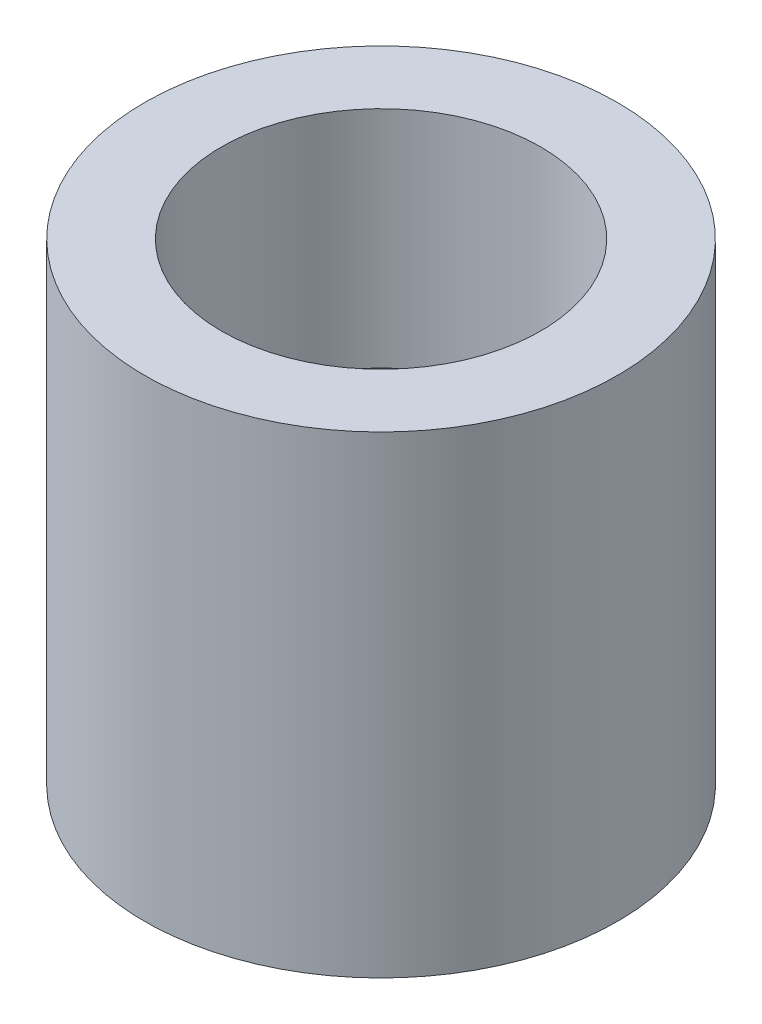
ISO-10303-21;
HEADER;
FILE_DESCRIPTION(('STEP AP214'),'2;1');
FILE_NAME('part.step','',(''),(''),'','','');
FILE_SCHEMA(('AUTOMOTIVE_DESIGN { 1 0 10303 214 1 1 1 1 }'));
ENDSEC;
DATA;
#1=APPLICATION_CONTEXT('core data for automotive mechanical design processes');
#2=APPLICATION_PROTOCOL_DEFINITION('international standard','automotive_design',2000,#1);
#3=PRODUCT_CONTEXT('',#1,'mechanical');
#4=PRODUCT('Part','Part','',(#3));
#5=PRODUCT_RELATED_PRODUCT_CATEGORY('part','',(#4));
#6=PRODUCT_DEFINITION_FORMATION('','',#4);
#7=PRODUCT_DEFINITION_CONTEXT('part definition',#1,'design');
#8=PRODUCT_DEFINITION('design','',#6,#7);
#9=PRODUCT_DEFINITION_SHAPE('','',#8);
#10=(LENGTH_UNIT() NAMED_UNIT(*) SI_UNIT(.MILLI.,.METRE.));
#11=(NAMED_UNIT(*) PLANE_ANGLE_UNIT() SI_UNIT($,.RADIAN.));
#12=(NAMED_UNIT(*) SI_UNIT($,.STERADIAN.) SOLID_ANGLE_UNIT());
#13=UNCERTAINTY_MEASURE_WITH_UNIT(LENGTH_MEASURE(1.E-05),#10,'distance_accuracy_value','');
#14=(GEOMETRIC_REPRESENTATION_CONTEXT(3) GLOBAL_UNCERTAINTY_ASSIGNED_CONTEXT((#13)) GLOBAL_UNIT_ASSIGNED_CONTEXT((#10,
#11,#12)) REPRESENTATION_CONTEXT('',''));
#15=CARTESIAN_POINT('',(0.,0.,0.));
#16=DIRECTION('',(0.,0.,1.));
#17=DIRECTION('',(1.,0.,0.));
#18=AXIS2_PLACEMENT_3D('',#15,#16,#17);
#19=CARTESIAN_POINT('',(0.,-6.71026961865118,0.));
#20=DIRECTION('',(0.,-1.,0.));
#21=DIRECTION('',(0.,0.,-1.));
#22=AXIS2_PLACEMENT_3D('',#19,#20,#21);
#23=CYLINDRICAL_SURFACE('',#22,7.25);
#24=CARTESIAN_POINT('',(0.,0.,0.));
#25=DIRECTION('',(0.,-1.,0.));
#26=DIRECTION('',(0.,0.,-1.));
#27=AXIS2_PLACEMENT_3D('',#24,#25,#26);
#28=CIRCLE('',#27,7.25);
#29=CARTESIAN_POINT('',(0.,0.,-7.25));
#30=VERTEX_POINT('',#29);
#31=EDGE_CURVE('E10',#30,#30,#28,.T.);
#32=ORIENTED_EDGE('',*,*,#31,.T.);
#33=EDGE_LOOP('',(#32));
#34=FACE_BOUND('',#33,.T.);
#35=CARTESIAN_POINT('',(0.,10.5,0.));
#36=DIRECTION('',(0.,-1.,0.));
#37=DIRECTION('',(0.,0.,-1.));
#38=AXIS2_PLACEMENT_3D('',#35,#36,#37);
#39=CIRCLE('',#38,7.25);
#40=CARTESIAN_POINT('',(0.,10.5,-7.25));
#41=VERTEX_POINT('',#40);
#42=EDGE_CURVE('E55',#41,#41,#39,.T.);
#43=ORIENTED_EDGE('',*,*,#42,.F.);
#44=EDGE_LOOP('',(#43));
#45=FACE_BOUND('',#44,.T.);
#46=ADVANCED_FACE('F33',(#34,#45),#23,.F.);
#47=CARTESIAN_POINT('',(7.25,0.,0.));
#48=DIRECTION('',(0.,-1.,0.));
#49=DIRECTION('',(0.,0.,-1.));
#50=AXIS2_PLACEMENT_3D('',#47,#48,#49);
#51=PLANE('',#50);
#52=CARTESIAN_POINT('',(0.,0.,0.));
#53=DIRECTION('',(0.,-1.,0.));
#54=DIRECTION('',(0.,0.,-1.));
#55=AXIS2_PLACEMENT_3D('',#52,#53,#54);
#56=CIRCLE('',#55,10.);
#57=CARTESIAN_POINT('',(0.,0.,-10.));
#58=VERTEX_POINT('',#57);
#59=EDGE_CURVE('E39',#58,#58,#56,.T.);
#60=ORIENTED_EDGE('',*,*,#59,.T.);
#61=EDGE_LOOP('',(#60));
#62=FACE_BOUND('',#61,.T.);
#63=ORIENTED_EDGE('',*,*,#31,.F.);
#64=EDGE_LOOP('',(#63));
#65=FACE_BOUND('',#64,.T.);
#66=ADVANCED_FACE('F63',(#62,#65),#51,.T.);
#67=CARTESIAN_POINT('',(0.,-6.71026961865118,0.));
#68=DIRECTION('',(0.,-1.,0.));
#69=DIRECTION('',(0.,0.,-1.));
#70=AXIS2_PLACEMENT_3D('',#67,#68,#69);
#71=CYLINDRICAL_SURFACE('',#70,10.);
#72=CARTESIAN_POINT('',(0.,20.,0.));
#73=DIRECTION('',(0.,-1.,0.));
#74=DIRECTION('',(0.,0.,-1.));
#75=AXIS2_PLACEMENT_3D('',#72,#73,#74);
#76=CIRCLE('',#75,10.);
#77=CARTESIAN_POINT('',(0.,20.,-10.));
#78=VERTEX_POINT('',#77);
#79=EDGE_CURVE('E43',#78,#78,#76,.T.);
#80=ORIENTED_EDGE('',*,*,#79,.T.);
#81=EDGE_LOOP('',(#80));
#82=FACE_BOUND('',#81,.T.);
#83=ORIENTED_EDGE('',*,*,#59,.F.);
#84=EDGE_LOOP('',(#83));
#85=FACE_BOUND('',#84,.T.);
#86=ADVANCED_FACE('F67',(#82,#85),#71,.T.);
#87=CARTESIAN_POINT('',(6.75,20.,0.));
#88=DIRECTION('',(0.,1.,0.));
#89=DIRECTION('',(0.,0.,1.));
#90=AXIS2_PLACEMENT_3D('',#87,#88,#89);
#91=PLANE('',#90);
#92=CARTESIAN_POINT('',(0.,20.,0.));
#93=DIRECTION('',(0.,-1.,0.));
#94=DIRECTION('',(0.,0.,-1.));
#95=AXIS2_PLACEMENT_3D('',#92,#93,#94);
#96=CIRCLE('',#95,6.75);
#97=CARTESIAN_POINT('',(0.,20.,-6.75));
#98=VERTEX_POINT('',#97);
#99=EDGE_CURVE('E47',#98,#98,#96,.T.);
#100=ORIENTED_EDGE('',*,*,#99,.T.);
#101=EDGE_LOOP('',(#100));
#102=FACE_BOUND('',#101,.T.);
#103=ORIENTED_EDGE('',*,*,#79,.F.);
#104=EDGE_LOOP('',(#103));
#105=FACE_BOUND('',#104,.T.);
#106=ADVANCED_FACE('F71',(#102,#105),#91,.T.);
#107=CARTESIAN_POINT('',(0.,-6.71026961865118,0.));
#108=DIRECTION('',(0.,-1.,0.));
#109=DIRECTION('',(0.,0.,-1.));
#110=AXIS2_PLACEMENT_3D('',#107,#108,#109);
#111=CYLINDRICAL_SURFACE('',#110,6.75);
#112=CARTESIAN_POINT('',(0.,10.5,0.));
#113=DIRECTION('',(0.,-1.,0.));
#114=DIRECTION('',(0.,0.,-1.));
#115=AXIS2_PLACEMENT_3D('',#112,#113,#114);
#116=CIRCLE('',#115,6.75);
#117=CARTESIAN_POINT('',(0.,10.5,-6.75));
#118=VERTEX_POINT('',#117);
#119=EDGE_CURVE('E52',#118,#118,#116,.T.);
#120=ORIENTED_EDGE('',*,*,#119,.T.);
#121=EDGE_LOOP('',(#120));
#122=FACE_BOUND('',#121,.T.);
#123=ORIENTED_EDGE('',*,*,#99,.F.);
#124=EDGE_LOOP('',(#123));
#125=FACE_BOUND('',#124,.T.);
#126=ADVANCED_FACE('F78',(#122,#125),#111,.F.);
#127=CARTESIAN_POINT('',(6.75,10.5,0.));
#128=DIRECTION('',(0.,-1.,0.));
#129=DIRECTION('',(0.,0.,-1.));
#130=AXIS2_PLACEMENT_3D('',#127,#128,#129);
#131=PLANE('',#130);
#132=ORIENTED_EDGE('',*,*,#42,.T.);
#133=EDGE_LOOP('',(#132));
#134=FACE_BOUND('',#133,.T.);
#135=ORIENTED_EDGE('',*,*,#119,.F.);
#136=EDGE_LOOP('',(#135));
#137=FACE_BOUND('',#136,.T.);
#138=ADVANCED_FACE('F59',(#134,#137),#131,.T.);
#139=CLOSED_SHELL('',(#46,#66,#86,#106,#126,#138));
#140=MANIFOLD_SOLID_BREP('B2',#139);
#141=ADVANCED_BREP_SHAPE_REPRESENTATION('',(#18,#140),#14);
#142=SHAPE_DEFINITION_REPRESENTATION(#9,#141);
ENDSEC;
END-ISO-10303-21;
